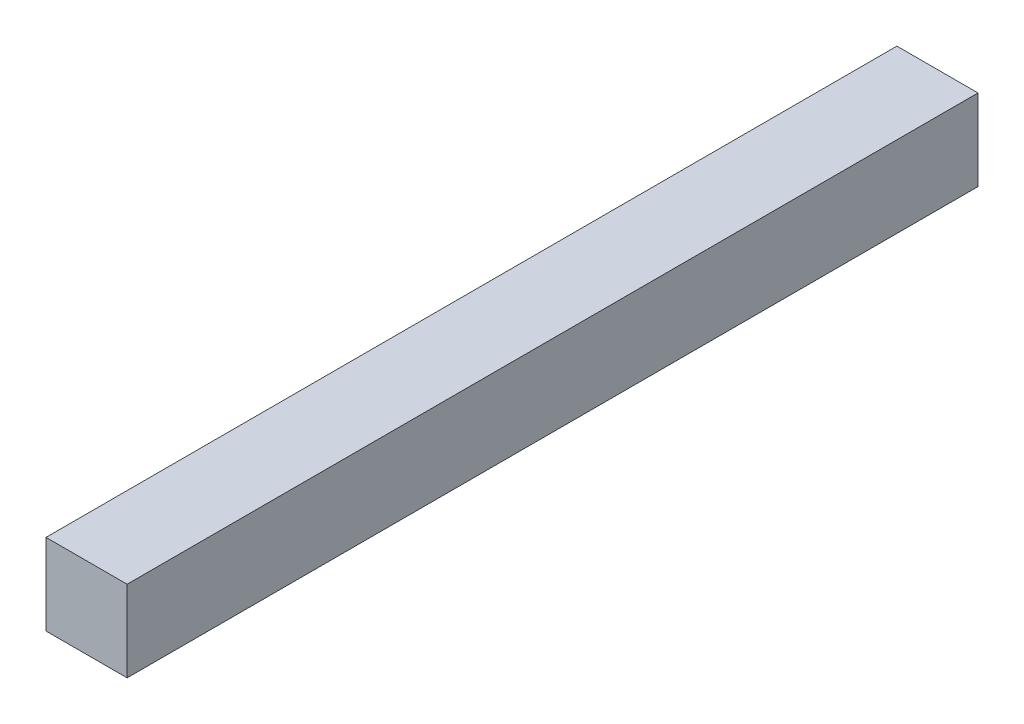
ISO-10303-21;
HEADER;
FILE_DESCRIPTION(('STEP AP214'),'2;1');
FILE_NAME('part.step','',(''),(''),'','','');
FILE_SCHEMA(('AUTOMOTIVE_DESIGN { 1 0 10303 214 1 1 1 1 }'));
ENDSEC;
DATA;
#1=APPLICATION_CONTEXT('core data for automotive mechanical design processes');
#2=APPLICATION_PROTOCOL_DEFINITION('international standard','automotive_design',2000,#1);
#3=PRODUCT_CONTEXT('',#1,'mechanical');
#4=PRODUCT('Part','Part','',(#3));
#5=PRODUCT_RELATED_PRODUCT_CATEGORY('part','',(#4));
#6=PRODUCT_DEFINITION_FORMATION('','',#4);
#7=PRODUCT_DEFINITION_CONTEXT('part definition',#1,'design');
#8=PRODUCT_DEFINITION('design','',#6,#7);
#9=PRODUCT_DEFINITION_SHAPE('','',#8);
#10=(LENGTH_UNIT() NAMED_UNIT(*) SI_UNIT(.MILLI.,.METRE.));
#11=(NAMED_UNIT(*) PLANE_ANGLE_UNIT() SI_UNIT($,.RADIAN.));
#12=(NAMED_UNIT(*) SI_UNIT($,.STERADIAN.) SOLID_ANGLE_UNIT());
#13=UNCERTAINTY_MEASURE_WITH_UNIT(LENGTH_MEASURE(1.E-05),#10,'distance_accuracy_value','');
#14=(GEOMETRIC_REPRESENTATION_CONTEXT(3) GLOBAL_UNCERTAINTY_ASSIGNED_CONTEXT((#13)) GLOBAL_UNIT_ASSIGNED_CONTEXT((#10,
#11,#12)) REPRESENTATION_CONTEXT('',''));
#15=CARTESIAN_POINT('',(0.,0.,0.));
#16=DIRECTION('',(0.,0.,1.));
#17=DIRECTION('',(1.,0.,0.));
#18=AXIS2_PLACEMENT_3D('',#15,#16,#17);
#19=CARTESIAN_POINT('',(-133.2,25.2,209.8));
#20=DIRECTION('',(1.,0.,0.));
#21=DIRECTION('',(0.,0.,-1.));
#22=AXIS2_PLACEMENT_3D('',#19,#20,#21);
#23=PLANE('',#22);
#24=DIRECTION('',(0.,-1.,0.));
#25=VECTOR('',#24,1.);
#26=CARTESIAN_POINT('',(-133.2,25.2,0.));
#27=LINE('',#26,#25);
#28=CARTESIAN_POINT('',(-133.2,25.2,0.));
#29=VERTEX_POINT('',#28);
#30=CARTESIAN_POINT('',(-133.2,5.19999999999999,0.));
#31=VERTEX_POINT('',#30);
#32=EDGE_CURVE('E96',#29,#31,#27,.T.);
#33=ORIENTED_EDGE('',*,*,#32,.T.);
#34=DIRECTION('',(0.,0.,-1.));
#35=VECTOR('',#34,1.);
#36=CARTESIAN_POINT('',(-133.2,5.19999999999999,209.8));
#37=LINE('',#36,#35);
#38=CARTESIAN_POINT('',(-133.2,5.19999999999999,209.8));
#39=VERTEX_POINT('',#38);
#40=EDGE_CURVE('E11',#39,#31,#37,.T.);
#41=ORIENTED_EDGE('',*,*,#40,.F.);
#42=DIRECTION('',(0.,-1.,0.));
#43=VECTOR('',#42,1.);
#44=CARTESIAN_POINT('',(-133.2,25.2,209.8));
#45=LINE('',#44,#43);
#46=CARTESIAN_POINT('',(-133.2,25.2,209.8));
#47=VERTEX_POINT('',#46);
#48=EDGE_CURVE('E84',#47,#39,#45,.T.);
#49=ORIENTED_EDGE('',*,*,#48,.F.);
#50=DIRECTION('',(0.,0.,-1.));
#51=VECTOR('',#50,1.);
#52=CARTESIAN_POINT('',(-133.2,25.2,209.8));
#53=LINE('',#52,#51);
#54=EDGE_CURVE('E92',#47,#29,#53,.T.);
#55=ORIENTED_EDGE('',*,*,#54,.T.);
#56=EDGE_LOOP('',(#33,#41,#49,#55));
#57=FACE_BOUND('',#56,.T.);
#58=ADVANCED_FACE('F33',(#57),#23,.F.);
#59=CARTESIAN_POINT('',(-133.2,5.19999999999999,209.8));
#60=DIRECTION('',(0.,1.,0.));
#61=DIRECTION('',(0.,0.,1.));
#62=AXIS2_PLACEMENT_3D('',#59,#60,#61);
#63=PLANE('',#62);
#64=DIRECTION('',(1.,0.,0.));
#65=VECTOR('',#64,1.);
#66=CARTESIAN_POINT('',(-133.2,5.19999999999999,0.));
#67=LINE('',#66,#65);
#68=CARTESIAN_POINT('',(-113.2,5.19999999999999,0.));
#69=VERTEX_POINT('',#68);
#70=EDGE_CURVE('E88',#31,#69,#67,.T.);
#71=ORIENTED_EDGE('',*,*,#70,.T.);
#72=DIRECTION('',(0.,0.,-1.));
#73=VECTOR('',#72,1.);
#74=CARTESIAN_POINT('',(-113.2,5.19999999999999,209.8));
#75=LINE('',#74,#73);
#76=CARTESIAN_POINT('',(-113.2,5.19999999999999,209.8));
#77=VERTEX_POINT('',#76);
#78=EDGE_CURVE('E41',#77,#69,#75,.T.);
#79=ORIENTED_EDGE('',*,*,#78,.F.);
#80=DIRECTION('',(1.,0.,0.));
#81=VECTOR('',#80,1.);
#82=CARTESIAN_POINT('',(-133.2,5.19999999999999,209.8));
#83=LINE('',#82,#81);
#84=EDGE_CURVE('E79',#39,#77,#83,.T.);
#85=ORIENTED_EDGE('',*,*,#84,.F.);
#86=ORIENTED_EDGE('',*,*,#40,.T.);
#87=EDGE_LOOP('',(#71,#79,#85,#86));
#88=FACE_BOUND('',#87,.T.);
#89=ADVANCED_FACE('F87',(#88),#63,.F.);
#90=CARTESIAN_POINT('',(-113.2,25.2,209.8));
#91=DIRECTION('',(-1.,0.,0.));
#92=DIRECTION('',(0.,0.,1.));
#93=AXIS2_PLACEMENT_3D('',#90,#91,#92);
#94=PLANE('',#93);
#95=DIRECTION('',(0.,1.,0.));
#96=VECTOR('',#95,1.);
#97=CARTESIAN_POINT('',(-113.2,25.2,0.));
#98=LINE('',#97,#96);
#99=CARTESIAN_POINT('',(-113.2,25.2,0.));
#100=VERTEX_POINT('',#99);
#101=EDGE_CURVE('E66',#69,#100,#98,.T.);
#102=ORIENTED_EDGE('',*,*,#101,.T.);
#103=DIRECTION('',(0.,0.,-1.));
#104=VECTOR('',#103,1.);
#105=CARTESIAN_POINT('',(-113.2,25.2,209.8));
#106=LINE('',#105,#104);
#107=CARTESIAN_POINT('',(-113.2,25.2,209.8));
#108=VERTEX_POINT('',#107);
#109=EDGE_CURVE('E89',#108,#100,#106,.T.);
#110=ORIENTED_EDGE('',*,*,#109,.F.);
#111=DIRECTION('',(0.,1.,0.));
#112=VECTOR('',#111,1.);
#113=CARTESIAN_POINT('',(-113.2,25.2,209.8));
#114=LINE('',#113,#112);
#115=EDGE_CURVE('E82',#77,#108,#114,.T.);
#116=ORIENTED_EDGE('',*,*,#115,.F.);
#117=ORIENTED_EDGE('',*,*,#78,.T.);
#118=EDGE_LOOP('',(#102,#110,#116,#117));
#119=FACE_BOUND('',#118,.T.);
#120=ADVANCED_FACE('F90',(#119),#94,.F.);
#121=CARTESIAN_POINT('',(-133.2,25.2,209.8));
#122=DIRECTION('',(0.,-1.,0.));
#123=DIRECTION('',(0.,0.,-1.));
#124=AXIS2_PLACEMENT_3D('',#121,#122,#123);
#125=PLANE('',#124);
#126=DIRECTION('',(-1.,0.,0.));
#127=VECTOR('',#126,1.);
#128=CARTESIAN_POINT('',(-133.2,25.2,0.));
#129=LINE('',#128,#127);
#130=EDGE_CURVE('E72',#100,#29,#129,.T.);
#131=ORIENTED_EDGE('',*,*,#130,.T.);
#132=ORIENTED_EDGE('',*,*,#54,.F.);
#133=DIRECTION('',(-1.,0.,0.));
#134=VECTOR('',#133,1.);
#135=CARTESIAN_POINT('',(-133.2,25.2,209.8));
#136=LINE('',#135,#134);
#137=EDGE_CURVE('E49',#108,#47,#136,.T.);
#138=ORIENTED_EDGE('',*,*,#137,.F.);
#139=ORIENTED_EDGE('',*,*,#109,.T.);
#140=EDGE_LOOP('',(#131,#132,#138,#139));
#141=FACE_BOUND('',#140,.T.);
#142=ADVANCED_FACE('F103',(#141),#125,.F.);
#143=CARTESIAN_POINT('',(0.,0.,209.8));
#144=DIRECTION('',(0.,0.,1.));
#145=DIRECTION('',(1.,0.,0.));
#146=AXIS2_PLACEMENT_3D('',#143,#144,#145);
#147=PLANE('',#146);
#148=ORIENTED_EDGE('',*,*,#48,.T.);
#149=ORIENTED_EDGE('',*,*,#84,.T.);
#150=ORIENTED_EDGE('',*,*,#115,.T.);
#151=ORIENTED_EDGE('',*,*,#137,.T.);
#152=EDGE_LOOP('',(#148,#149,#150,#151));
#153=FACE_BOUND('',#152,.T.);
#154=ADVANCED_FACE('F80',(#153),#147,.T.);
#155=CARTESIAN_POINT('',(0.,0.,0.));
#156=DIRECTION('',(0.,0.,1.));
#157=DIRECTION('',(1.,0.,0.));
#158=AXIS2_PLACEMENT_3D('',#155,#156,#157);
#159=PLANE('',#158);
#160=ORIENTED_EDGE('',*,*,#32,.F.);
#161=ORIENTED_EDGE('',*,*,#130,.F.);
#162=ORIENTED_EDGE('',*,*,#101,.F.);
#163=ORIENTED_EDGE('',*,*,#70,.F.);
#164=EDGE_LOOP('',(#160,#161,#162,#163));
#165=FACE_BOUND('',#164,.T.);
#166=ADVANCED_FACE('F106',(#165),#159,.F.);
#167=CLOSED_SHELL('',(#58,#89,#120,#142,#154,#166));
#168=MANIFOLD_SOLID_BREP('B2',#167);
#169=ADVANCED_BREP_SHAPE_REPRESENTATION('',(#18,#168),#14);
#170=SHAPE_DEFINITION_REPRESENTATION(#9,#169);
ENDSEC;
END-ISO-10303-21;
